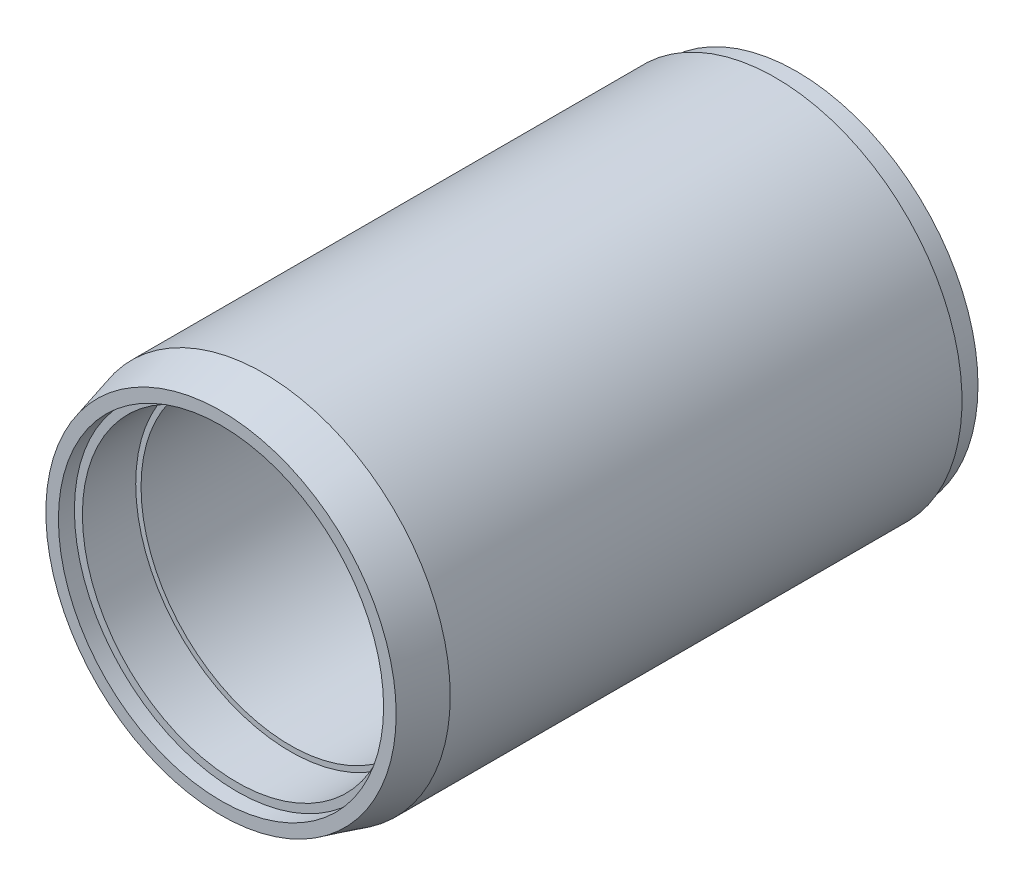
ISO-10303-21;
HEADER;
FILE_DESCRIPTION(('STEP AP214'),'2;1');
FILE_NAME('part.step','',(''),(''),'','','');
FILE_SCHEMA(('AUTOMOTIVE_DESIGN { 1 0 10303 214 1 1 1 1 }'));
ENDSEC;
DATA;
#1=APPLICATION_CONTEXT('core data for automotive mechanical design processes');
#2=APPLICATION_PROTOCOL_DEFINITION('international standard','automotive_design',2000,#1);
#3=PRODUCT_CONTEXT('',#1,'mechanical');
#4=PRODUCT('Part','Part','',(#3));
#5=PRODUCT_RELATED_PRODUCT_CATEGORY('part','',(#4));
#6=PRODUCT_DEFINITION_FORMATION('','',#4);
#7=PRODUCT_DEFINITION_CONTEXT('part definition',#1,'design');
#8=PRODUCT_DEFINITION('design','',#6,#7);
#9=PRODUCT_DEFINITION_SHAPE('','',#8);
#10=(LENGTH_UNIT() NAMED_UNIT(*) SI_UNIT(.MILLI.,.METRE.));
#11=(NAMED_UNIT(*) PLANE_ANGLE_UNIT() SI_UNIT($,.RADIAN.));
#12=(NAMED_UNIT(*) SI_UNIT($,.STERADIAN.) SOLID_ANGLE_UNIT());
#13=UNCERTAINTY_MEASURE_WITH_UNIT(LENGTH_MEASURE(1.E-05),#10,'distance_accuracy_value','');
#14=(GEOMETRIC_REPRESENTATION_CONTEXT(3) GLOBAL_UNCERTAINTY_ASSIGNED_CONTEXT((#13)) GLOBAL_UNIT_ASSIGNED_CONTEXT((#10,
#11,#12)) REPRESENTATION_CONTEXT('',''));
#15=CARTESIAN_POINT('',(0.,0.,0.));
#16=DIRECTION('',(0.,0.,1.));
#17=DIRECTION('',(1.,0.,0.));
#18=AXIS2_PLACEMENT_3D('',#15,#16,#17);
#19=CARTESIAN_POINT('',(0.,0.,13.3));
#20=DIRECTION('',(0.,0.,-1.));
#21=DIRECTION('',(-1.,0.,0.));
#22=AXIS2_PLACEMENT_3D('',#19,#20,#21);
#23=CYLINDRICAL_SURFACE('',#22,16.);
#24=CARTESIAN_POINT('',(0.,0.,13.3));
#25=DIRECTION('',(0.,0.,-1.));
#26=DIRECTION('',(-1.,0.,0.));
#27=AXIS2_PLACEMENT_3D('',#24,#25,#26);
#28=CIRCLE('',#27,16.);
#29=CARTESIAN_POINT('',(-16.,0.,13.3));
#30=VERTEX_POINT('',#29);
#31=EDGE_CURVE('E63',#30,#30,#28,.T.);
#32=ORIENTED_EDGE('',*,*,#31,.F.);
#33=EDGE_LOOP('',(#32));
#34=FACE_BOUND('',#33,.T.);
#35=CARTESIAN_POINT('',(0.,0.,1.3));
#36=DIRECTION('',(0.,0.,-1.));
#37=DIRECTION('',(-1.,0.,0.));
#38=AXIS2_PLACEMENT_3D('',#35,#36,#37);
#39=CIRCLE('',#38,16.);
#40=CARTESIAN_POINT('',(-16.,0.,1.3));
#41=VERTEX_POINT('',#40);
#42=EDGE_CURVE('E64',#41,#41,#39,.F.);
#43=ORIENTED_EDGE('',*,*,#42,.F.);
#44=EDGE_LOOP('',(#43));
#45=FACE_BOUND('',#44,.T.);
#46=ADVANCED_FACE('F31',(#34,#45),#23,.F.);
#47=CARTESIAN_POINT('',(0.,0.,54.));
#48=DIRECTION('',(0.,0.,-1.));
#49=DIRECTION('',(-1.,0.,0.));
#50=AXIS2_PLACEMENT_3D('',#47,#48,#49);
#51=CYLINDRICAL_SURFACE('',#50,14.);
#52=CARTESIAN_POINT('',(0.,0.,47.5));
#53=DIRECTION('',(0.,0.,1.));
#54=DIRECTION('',(1.,0.,0.));
#55=AXIS2_PLACEMENT_3D('',#52,#53,#54);
#56=CIRCLE('',#55,14.);
#57=CARTESIAN_POINT('',(14.,0.,47.5));
#58=VERTEX_POINT('',#57);
#59=EDGE_CURVE('E51',#58,#58,#56,.T.);
#60=ORIENTED_EDGE('',*,*,#59,.T.);
#61=EDGE_LOOP('',(#60));
#62=FACE_BOUND('',#61,.T.);
#63=CARTESIAN_POINT('',(0.,0.,13.3));
#64=DIRECTION('',(0.,0.,-1.));
#65=DIRECTION('',(-1.,0.,0.));
#66=AXIS2_PLACEMENT_3D('',#63,#64,#65);
#67=CIRCLE('',#66,14.);
#68=CARTESIAN_POINT('',(-14.,0.,13.3));
#69=VERTEX_POINT('',#68);
#70=EDGE_CURVE('E61',#69,#69,#67,.T.);
#71=ORIENTED_EDGE('',*,*,#70,.T.);
#72=EDGE_LOOP('',(#71));
#73=FACE_BOUND('',#72,.T.);
#74=ADVANCED_FACE('F106',(#62,#73),#51,.F.);
#75=CARTESIAN_POINT('',(0.,0.,0.));
#76=DIRECTION('',(0.,0.,1.));
#77=DIRECTION('',(1.,0.,0.));
#78=AXIS2_PLACEMENT_3D('',#75,#76,#77);
#79=PLANE('',#78);
#80=CARTESIAN_POINT('',(0.,0.,0.));
#81=DIRECTION('',(0.,0.,-1.));
#82=DIRECTION('',(-1.,0.,0.));
#83=AXIS2_PLACEMENT_3D('',#80,#81,#82);
#84=CIRCLE('',#83,16.75);
#85=CARTESIAN_POINT('',(-16.75,0.,0.));
#86=VERTEX_POINT('',#85);
#87=EDGE_CURVE('E72',#86,#86,#84,.T.);
#88=ORIENTED_EDGE('',*,*,#87,.F.);
#89=EDGE_LOOP('',(#88));
#90=FACE_BOUND('',#89,.T.);
#91=CARTESIAN_POINT('',(0.,0.,0.));
#92=DIRECTION('',(0.,0.,-1.));
#93=DIRECTION('',(-1.,0.,0.));
#94=AXIS2_PLACEMENT_3D('',#91,#92,#93);
#95=CIRCLE('',#94,17.);
#96=CARTESIAN_POINT('',(-17.,0.,0.));
#97=VERTEX_POINT('',#96);
#98=EDGE_CURVE('E60',#97,#97,#95,.T.);
#99=ORIENTED_EDGE('',*,*,#98,.T.);
#100=EDGE_LOOP('',(#99));
#101=FACE_BOUND('',#100,.T.);
#102=ADVANCED_FACE('F103',(#90,#101),#79,.F.);
#103=CARTESIAN_POINT('',(0.,0.,54.));
#104=DIRECTION('',(0.,0.,-1.));
#105=DIRECTION('',(-1.,0.,0.));
#106=AXIS2_PLACEMENT_3D('',#103,#104,#105);
#107=CYLINDRICAL_SURFACE('',#106,17.5);
#108=CARTESIAN_POINT('',(0.,0.,50.));
#109=DIRECTION('',(0.,0.,1.));
#110=DIRECTION('',(1.,0.,0.));
#111=AXIS2_PLACEMENT_3D('',#108,#109,#110);
#112=CIRCLE('',#111,17.5);
#113=CARTESIAN_POINT('',(17.5,0.,50.));
#114=VERTEX_POINT('',#113);
#115=EDGE_CURVE('E38',#114,#114,#112,.F.);
#116=ORIENTED_EDGE('',*,*,#115,.T.);
#117=EDGE_LOOP('',(#116));
#118=FACE_BOUND('',#117,.T.);
#119=CARTESIAN_POINT('',(0.,0.,2.));
#120=DIRECTION('',(0.,0.,-1.));
#121=DIRECTION('',(-1.,0.,0.));
#122=AXIS2_PLACEMENT_3D('',#119,#120,#121);
#123=CIRCLE('',#122,17.5);
#124=CARTESIAN_POINT('',(-17.5,0.,2.));
#125=VERTEX_POINT('',#124);
#126=EDGE_CURVE('E56',#125,#125,#123,.T.);
#127=ORIENTED_EDGE('',*,*,#126,.F.);
#128=EDGE_LOOP('',(#127));
#129=FACE_BOUND('',#128,.T.);
#130=ADVANCED_FACE('F33',(#118,#129),#107,.T.);
#131=CARTESIAN_POINT('',(0.,0.,54.));
#132=DIRECTION('',(0.,0.,1.));
#133=DIRECTION('',(1.,0.,0.));
#134=AXIS2_PLACEMENT_3D('',#131,#132,#133);
#135=PLANE('',#134);
#136=CARTESIAN_POINT('',(0.,0.,54.));
#137=DIRECTION('',(0.,0.,1.));
#138=DIRECTION('',(1.,0.,0.));
#139=AXIS2_PLACEMENT_3D('',#136,#137,#138);
#140=CIRCLE('',#139,16.4282032302755);
#141=CARTESIAN_POINT('',(16.4282032302755,0.,54.));
#142=VERTEX_POINT('',#141);
#143=EDGE_CURVE('E42',#142,#142,#140,.T.);
#144=ORIENTED_EDGE('',*,*,#143,.T.);
#145=EDGE_LOOP('',(#144));
#146=FACE_BOUND('',#145,.T.);
#147=CARTESIAN_POINT('',(0.,0.,54.));
#148=DIRECTION('',(0.,0.,1.));
#149=DIRECTION('',(1.,0.,0.));
#150=AXIS2_PLACEMENT_3D('',#147,#148,#149);
#151=CIRCLE('',#150,15.25);
#152=CARTESIAN_POINT('',(15.25,0.,54.));
#153=VERTEX_POINT('',#152);
#154=EDGE_CURVE('E54',#153,#153,#151,.T.);
#155=ORIENTED_EDGE('',*,*,#154,.F.);
#156=EDGE_LOOP('',(#155));
#157=FACE_BOUND('',#156,.T.);
#158=ADVANCED_FACE('F94',(#146,#157),#135,.T.);
#159=CARTESIAN_POINT('',(0.,0.,52.5));
#160=DIRECTION('',(0.,0.,1.));
#161=DIRECTION('',(1.,0.,0.));
#162=AXIS2_PLACEMENT_3D('',#159,#160,#161);
#163=CYLINDRICAL_SURFACE('',#162,15.25);
#164=CARTESIAN_POINT('',(0.,0.,52.5));
#165=DIRECTION('',(0.,0.,1.));
#166=DIRECTION('',(1.,0.,0.));
#167=AXIS2_PLACEMENT_3D('',#164,#165,#166);
#168=CIRCLE('',#167,15.25);
#169=CARTESIAN_POINT('',(15.25,0.,52.5));
#170=VERTEX_POINT('',#169);
#171=EDGE_CURVE('E47',#170,#170,#168,.T.);
#172=ORIENTED_EDGE('',*,*,#171,.F.);
#173=EDGE_LOOP('',(#172));
#174=FACE_BOUND('',#173,.T.);
#175=ORIENTED_EDGE('',*,*,#154,.T.);
#176=EDGE_LOOP('',(#175));
#177=FACE_BOUND('',#176,.T.);
#178=ADVANCED_FACE('F91',(#174,#177),#163,.F.);
#179=CARTESIAN_POINT('',(0.,0.,52.5));
#180=DIRECTION('',(0.,0.,1.));
#181=DIRECTION('',(1.,0.,0.));
#182=AXIS2_PLACEMENT_3D('',#179,#180,#181);
#183=PLANE('',#182);
#184=CARTESIAN_POINT('',(0.,0.,52.5));
#185=DIRECTION('',(0.,0.,1.));
#186=DIRECTION('',(1.,0.,0.));
#187=AXIS2_PLACEMENT_3D('',#184,#185,#186);
#188=CIRCLE('',#187,14.5);
#189=CARTESIAN_POINT('',(14.5,0.,52.5));
#190=VERTEX_POINT('',#189);
#191=EDGE_CURVE('E59',#190,#190,#188,.T.);
#192=ORIENTED_EDGE('',*,*,#191,.F.);
#193=EDGE_LOOP('',(#192));
#194=FACE_BOUND('',#193,.T.);
#195=ORIENTED_EDGE('',*,*,#171,.T.);
#196=EDGE_LOOP('',(#195));
#197=FACE_BOUND('',#196,.T.);
#198=ADVANCED_FACE('F89',(#194,#197),#183,.T.);
#199=CARTESIAN_POINT('',(0.,0.,54.));
#200=DIRECTION('',(0.,0.,-1.));
#201=DIRECTION('',(-1.,0.,0.));
#202=AXIS2_PLACEMENT_3D('',#199,#200,#201);
#203=CONICAL_SURFACE('',#202,16.4282032302755,0.261799387799156);
#204=ORIENTED_EDGE('',*,*,#115,.F.);
#205=EDGE_LOOP('',(#204));
#206=FACE_BOUND('',#205,.T.);
#207=ORIENTED_EDGE('',*,*,#143,.F.);
#208=EDGE_LOOP('',(#207));
#209=FACE_BOUND('',#208,.T.);
#210=ADVANCED_FACE('F130',(#206,#209),#203,.T.);
#211=CARTESIAN_POINT('',(0.,0.,47.5));
#212=DIRECTION('',(0.,0.,1.));
#213=DIRECTION('',(1.,0.,0.));
#214=AXIS2_PLACEMENT_3D('',#211,#212,#213);
#215=CYLINDRICAL_SURFACE('',#214,14.5);
#216=CARTESIAN_POINT('',(0.,0.,47.5));
#217=DIRECTION('',(0.,0.,1.));
#218=DIRECTION('',(1.,0.,0.));
#219=AXIS2_PLACEMENT_3D('',#216,#217,#218);
#220=CIRCLE('',#219,14.5);
#221=CARTESIAN_POINT('',(14.5,0.,47.5));
#222=VERTEX_POINT('',#221);
#223=EDGE_CURVE('E55',#222,#222,#220,.T.);
#224=ORIENTED_EDGE('',*,*,#223,.F.);
#225=EDGE_LOOP('',(#224));
#226=FACE_BOUND('',#225,.T.);
#227=ORIENTED_EDGE('',*,*,#191,.T.);
#228=EDGE_LOOP('',(#227));
#229=FACE_BOUND('',#228,.T.);
#230=ADVANCED_FACE('F126',(#226,#229),#215,.F.);
#231=CARTESIAN_POINT('',(0.,0.,47.5));
#232=DIRECTION('',(0.,0.,1.));
#233=DIRECTION('',(1.,0.,0.));
#234=AXIS2_PLACEMENT_3D('',#231,#232,#233);
#235=PLANE('',#234);
#236=ORIENTED_EDGE('',*,*,#59,.F.);
#237=EDGE_LOOP('',(#236));
#238=FACE_BOUND('',#237,.T.);
#239=ORIENTED_EDGE('',*,*,#223,.T.);
#240=EDGE_LOOP('',(#239));
#241=FACE_BOUND('',#240,.T.);
#242=ADVANCED_FACE('F123',(#238,#241),#235,.T.);
#243=CARTESIAN_POINT('',(0.,0.,2.));
#244=DIRECTION('',(0.,0.,-1.));
#245=DIRECTION('',(-1.,0.,0.));
#246=AXIS2_PLACEMENT_3D('',#243,#244,#245);
#247=CYLINDRICAL_SURFACE('',#246,17.);
#248=CARTESIAN_POINT('',(0.,0.,1.86602540378444));
#249=DIRECTION('',(0.,0.,-1.));
#250=DIRECTION('',(-1.,0.,0.));
#251=AXIS2_PLACEMENT_3D('',#248,#249,#250);
#252=CIRCLE('',#251,17.);
#253=CARTESIAN_POINT('',(-17.,0.,1.86602540378444));
#254=VERTEX_POINT('',#253);
#255=EDGE_CURVE('E10',#254,#254,#252,.T.);
#256=ORIENTED_EDGE('',*,*,#255,.T.);
#257=EDGE_LOOP('',(#256));
#258=FACE_BOUND('',#257,.T.);
#259=ORIENTED_EDGE('',*,*,#98,.F.);
#260=EDGE_LOOP('',(#259));
#261=FACE_BOUND('',#260,.T.);
#262=ADVANCED_FACE('F120',(#258,#261),#247,.T.);
#263=CARTESIAN_POINT('',(0.,0.,13.3));
#264=DIRECTION('',(0.,0.,-1.));
#265=DIRECTION('',(-1.,0.,0.));
#266=AXIS2_PLACEMENT_3D('',#263,#264,#265);
#267=PLANE('',#266);
#268=ORIENTED_EDGE('',*,*,#70,.F.);
#269=EDGE_LOOP('',(#268));
#270=FACE_BOUND('',#269,.T.);
#271=ORIENTED_EDGE('',*,*,#31,.T.);
#272=EDGE_LOOP('',(#271));
#273=FACE_BOUND('',#272,.T.);
#274=ADVANCED_FACE('F118',(#270,#273),#267,.T.);
#275=CARTESIAN_POINT('',(0.,0.,1.3));
#276=DIRECTION('',(0.,0.,-1.));
#277=DIRECTION('',(-1.,0.,0.));
#278=AXIS2_PLACEMENT_3D('',#275,#276,#277);
#279=PLANE('',#278);
#280=CARTESIAN_POINT('',(0.,0.,1.3));
#281=DIRECTION('',(0.,0.,-1.));
#282=DIRECTION('',(-1.,0.,0.));
#283=AXIS2_PLACEMENT_3D('',#280,#281,#282);
#284=CIRCLE('',#283,16.75);
#285=CARTESIAN_POINT('',(-16.75,0.,1.3));
#286=VERTEX_POINT('',#285);
#287=EDGE_CURVE('E66',#286,#286,#284,.T.);
#288=ORIENTED_EDGE('',*,*,#287,.T.);
#289=EDGE_LOOP('',(#288));
#290=FACE_BOUND('',#289,.T.);
#291=ORIENTED_EDGE('',*,*,#42,.T.);
#292=EDGE_LOOP('',(#291));
#293=FACE_BOUND('',#292,.T.);
#294=ADVANCED_FACE('F149',(#290,#293),#279,.T.);
#295=CARTESIAN_POINT('',(0.,0.,1.3));
#296=DIRECTION('',(0.,0.,-1.));
#297=DIRECTION('',(-1.,0.,0.));
#298=AXIS2_PLACEMENT_3D('',#295,#296,#297);
#299=CYLINDRICAL_SURFACE('',#298,16.75);
#300=ORIENTED_EDGE('',*,*,#287,.F.);
#301=EDGE_LOOP('',(#300));
#302=FACE_BOUND('',#301,.T.);
#303=ORIENTED_EDGE('',*,*,#87,.T.);
#304=EDGE_LOOP('',(#303));
#305=FACE_BOUND('',#304,.T.);
#306=ADVANCED_FACE('F146',(#302,#305),#299,.F.);
#307=CARTESIAN_POINT('',(0.,0.,1.86602540378444));
#308=DIRECTION('',(0.,0.,1.));
#309=DIRECTION('',(1.,0.,0.));
#310=AXIS2_PLACEMENT_3D('',#307,#308,#309);
#311=CONICAL_SURFACE('',#310,17.,1.30899693899574);
#312=ORIENTED_EDGE('',*,*,#126,.T.);
#313=EDGE_LOOP('',(#312));
#314=FACE_BOUND('',#313,.T.);
#315=ORIENTED_EDGE('',*,*,#255,.F.);
#316=EDGE_LOOP('',(#315));
#317=FACE_BOUND('',#316,.T.);
#318=ADVANCED_FACE('F148',(#314,#317),#311,.T.);
#319=CLOSED_SHELL('',(#46,#74,#102,#130,#158,#178,#198,#210,#230,#242,#262,#274,#294,#306,#318));
#320=MANIFOLD_SOLID_BREP('B2',#319);
#321=ADVANCED_BREP_SHAPE_REPRESENTATION('',(#18,#320),#14);
#322=SHAPE_DEFINITION_REPRESENTATION(#9,#321);
ENDSEC;
END-ISO-10303-21;
